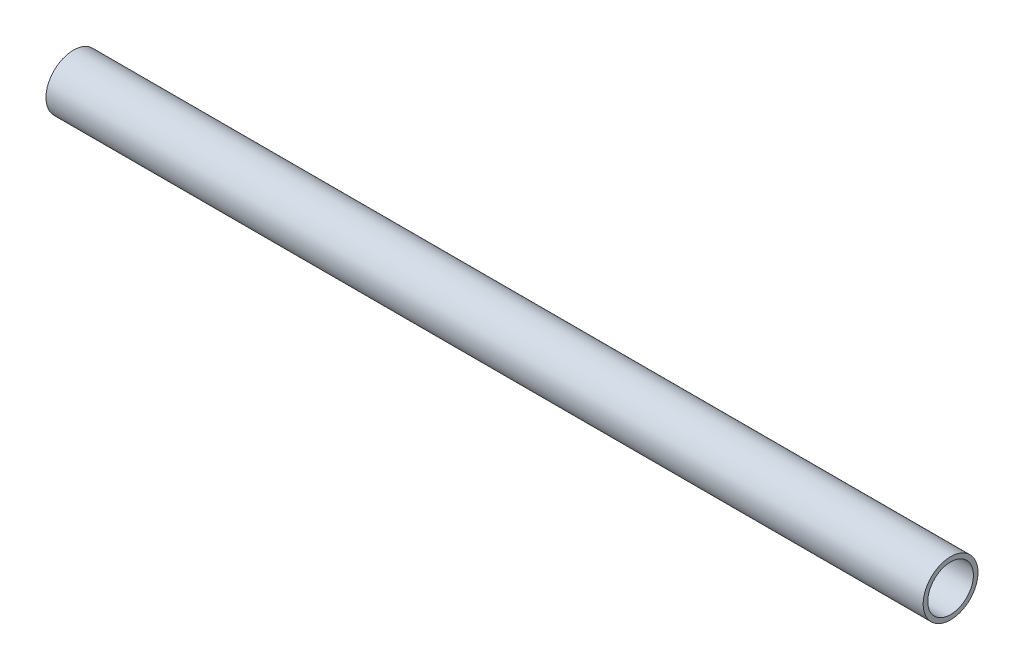
ISO-10303-21;
HEADER;
FILE_DESCRIPTION(('STEP AP214'),'2;1');
FILE_NAME('part.step','',(''),(''),'','','');
FILE_SCHEMA(('AUTOMOTIVE_DESIGN { 1 0 10303 214 1 1 1 1 }'));
ENDSEC;
DATA;
#1=APPLICATION_CONTEXT('core data for automotive mechanical design processes');
#2=APPLICATION_PROTOCOL_DEFINITION('international standard','automotive_design',2000,#1);
#3=PRODUCT_CONTEXT('',#1,'mechanical');
#4=PRODUCT('Part','Part','',(#3));
#5=PRODUCT_RELATED_PRODUCT_CATEGORY('part','',(#4));
#6=PRODUCT_DEFINITION_FORMATION('','',#4);
#7=PRODUCT_DEFINITION_CONTEXT('part definition',#1,'design');
#8=PRODUCT_DEFINITION('design','',#6,#7);
#9=PRODUCT_DEFINITION_SHAPE('','',#8);
#10=(LENGTH_UNIT() NAMED_UNIT(*) SI_UNIT(.MILLI.,.METRE.));
#11=(NAMED_UNIT(*) PLANE_ANGLE_UNIT() SI_UNIT($,.RADIAN.));
#12=(NAMED_UNIT(*) SI_UNIT($,.STERADIAN.) SOLID_ANGLE_UNIT());
#13=UNCERTAINTY_MEASURE_WITH_UNIT(LENGTH_MEASURE(1.E-05),#10,'distance_accuracy_value','');
#14=(GEOMETRIC_REPRESENTATION_CONTEXT(3) GLOBAL_UNCERTAINTY_ASSIGNED_CONTEXT((#13)) GLOBAL_UNIT_ASSIGNED_CONTEXT((#10,
#11,#12)) REPRESENTATION_CONTEXT('',''));
#15=CARTESIAN_POINT('',(0.,0.,0.));
#16=DIRECTION('',(0.,0.,1.));
#17=DIRECTION('',(1.,0.,0.));
#18=AXIS2_PLACEMENT_3D('',#15,#16,#17);
#19=CARTESIAN_POINT('',(220.825742450984,1527.51279613653,0.));
#20=DIRECTION('',(-1.,0.,0.));
#21=DIRECTION('',(0.,0.,1.));
#22=AXIS2_PLACEMENT_3D('',#19,#20,#21);
#23=CYLINDRICAL_SURFACE('',#22,5.28319999999993);
#24=CARTESIAN_POINT('',(220.825742450984,1527.51279613653,0.));
#25=DIRECTION('',(1.,0.,0.));
#26=DIRECTION('',(0.,0.,-1.));
#27=AXIS2_PLACEMENT_3D('',#24,#25,#26);
#28=CIRCLE('',#27,5.28319999999993);
#29=CARTESIAN_POINT('',(220.825742450984,1527.51279613653,-5.28319999999993));
#30=VERTEX_POINT('',#29);
#31=EDGE_CURVE('E45',#30,#30,#28,.T.);
#32=ORIENTED_EDGE('',*,*,#31,.T.);
#33=EDGE_LOOP('',(#32));
#34=FACE_BOUND('',#33,.T.);
#35=CARTESIAN_POINT('',(17.622221572135,1527.51279613653,0.));
#36=DIRECTION('',(1.,0.,0.));
#37=DIRECTION('',(0.,0.,-1.));
#38=AXIS2_PLACEMENT_3D('',#35,#36,#37);
#39=CIRCLE('',#38,5.28319999999993);
#40=CARTESIAN_POINT('',(17.622221572135,1527.51279613653,-5.28319999999993));
#41=VERTEX_POINT('',#40);
#42=EDGE_CURVE('E51',#41,#41,#39,.T.);
#43=ORIENTED_EDGE('',*,*,#42,.F.);
#44=EDGE_LOOP('',(#43));
#45=FACE_BOUND('',#44,.T.);
#46=ADVANCED_FACE('F38',(#34,#45),#23,.F.);
#47=CARTESIAN_POINT('',(220.825742450984,1527.51279613653,0.));
#48=DIRECTION('',(-1.,0.,0.));
#49=DIRECTION('',(0.,0.,1.));
#50=AXIS2_PLACEMENT_3D('',#47,#48,#49);
#51=CYLINDRICAL_SURFACE('',#50,6.34999999999994);
#52=CARTESIAN_POINT('',(220.825742450984,1527.51279613653,0.));
#53=DIRECTION('',(1.,0.,0.));
#54=DIRECTION('',(0.,0.,-1.));
#55=AXIS2_PLACEMENT_3D('',#52,#53,#54);
#56=CIRCLE('',#55,6.34999999999994);
#57=CARTESIAN_POINT('',(220.825742450984,1527.51279613653,-6.34999999999994));
#58=VERTEX_POINT('',#57);
#59=EDGE_CURVE('E11',#58,#58,#56,.T.);
#60=ORIENTED_EDGE('',*,*,#59,.F.);
#61=EDGE_LOOP('',(#60));
#62=FACE_BOUND('',#61,.T.);
#63=CARTESIAN_POINT('',(17.622221572135,1527.51279613653,0.));
#64=DIRECTION('',(1.,0.,0.));
#65=DIRECTION('',(0.,0.,-1.));
#66=AXIS2_PLACEMENT_3D('',#63,#64,#65);
#67=CIRCLE('',#66,6.34999999999994);
#68=CARTESIAN_POINT('',(17.622221572135,1527.51279613653,-6.34999999999994));
#69=VERTEX_POINT('',#68);
#70=EDGE_CURVE('E41',#69,#69,#67,.T.);
#71=ORIENTED_EDGE('',*,*,#70,.T.);
#72=EDGE_LOOP('',(#71));
#73=FACE_BOUND('',#72,.T.);
#74=ADVANCED_FACE('F58',(#62,#73),#51,.T.);
#75=CARTESIAN_POINT('',(220.825742450984,1527.51279613653,0.));
#76=DIRECTION('',(1.,0.,0.));
#77=DIRECTION('',(0.,0.,-1.));
#78=AXIS2_PLACEMENT_3D('',#75,#76,#77);
#79=PLANE('',#78);
#80=ORIENTED_EDGE('',*,*,#31,.F.);
#81=EDGE_LOOP('',(#80));
#82=FACE_BOUND('',#81,.T.);
#83=ORIENTED_EDGE('',*,*,#59,.T.);
#84=EDGE_LOOP('',(#83));
#85=FACE_BOUND('',#84,.T.);
#86=ADVANCED_FACE('F62',(#82,#85),#79,.T.);
#87=CARTESIAN_POINT('',(17.622221572135,1527.51279613653,0.));
#88=DIRECTION('',(1.,0.,0.));
#89=DIRECTION('',(0.,0.,-1.));
#90=AXIS2_PLACEMENT_3D('',#87,#88,#89);
#91=PLANE('',#90);
#92=ORIENTED_EDGE('',*,*,#42,.T.);
#93=EDGE_LOOP('',(#92));
#94=FACE_BOUND('',#93,.T.);
#95=ORIENTED_EDGE('',*,*,#70,.F.);
#96=EDGE_LOOP('',(#95));
#97=FACE_BOUND('',#96,.T.);
#98=ADVANCED_FACE('F60',(#94,#97),#91,.F.);
#99=CLOSED_SHELL('',(#46,#74,#86,#98));
#100=MANIFOLD_SOLID_BREP('B2',#99);
#101=ADVANCED_BREP_SHAPE_REPRESENTATION('',(#18,#100),#14);
#102=SHAPE_DEFINITION_REPRESENTATION(#9,#101);
ENDSEC;
END-ISO-10303-21;
